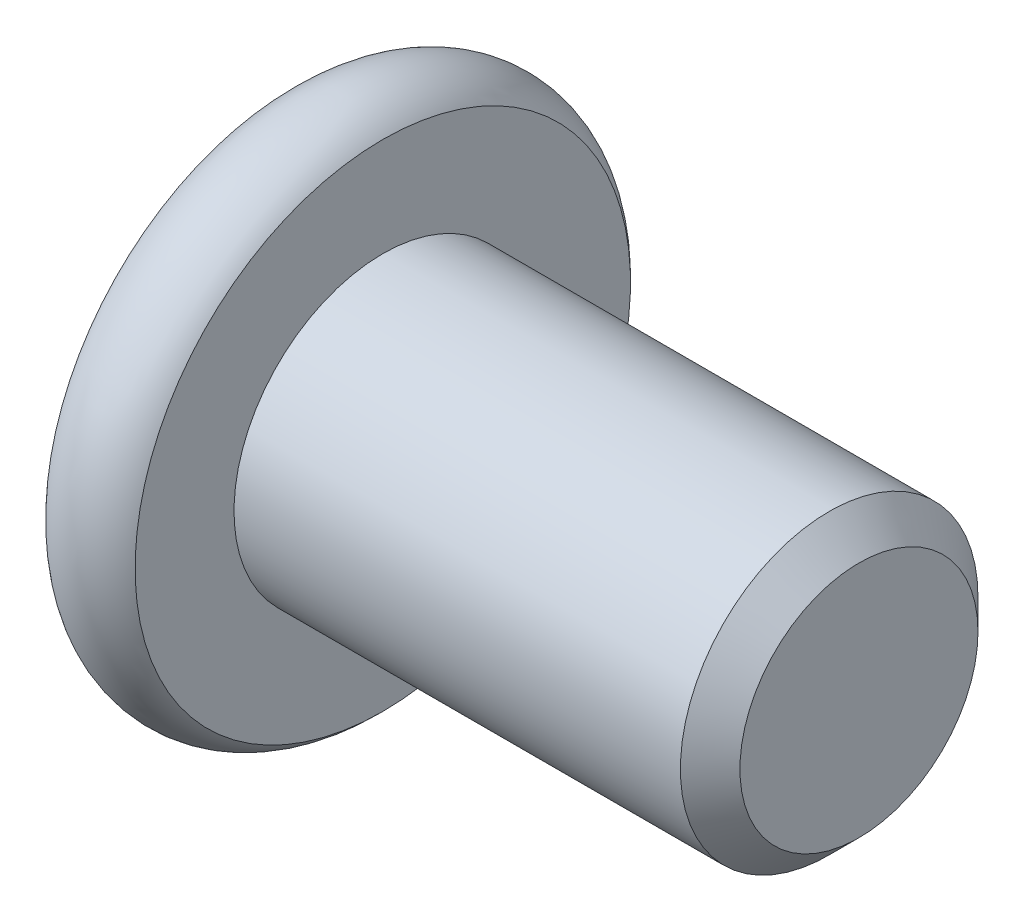
ISO-10303-21;
HEADER;
FILE_DESCRIPTION(('STEP AP214'),'2;1');
FILE_NAME('part.step','',(''),(''),'','','');
FILE_SCHEMA(('AUTOMOTIVE_DESIGN { 1 0 10303 214 1 1 1 1 }'));
ENDSEC;
DATA;
#1=APPLICATION_CONTEXT('core data for automotive mechanical design processes');
#2=APPLICATION_PROTOCOL_DEFINITION('international standard','automotive_design',2000,#1);
#3=PRODUCT_CONTEXT('',#1,'mechanical');
#4=PRODUCT('Part','Part','',(#3));
#5=PRODUCT_RELATED_PRODUCT_CATEGORY('part','',(#4));
#6=PRODUCT_DEFINITION_FORMATION('','',#4);
#7=PRODUCT_DEFINITION_CONTEXT('part definition',#1,'design');
#8=PRODUCT_DEFINITION('design','',#6,#7);
#9=PRODUCT_DEFINITION_SHAPE('','',#8);
#10=(LENGTH_UNIT() NAMED_UNIT(*) SI_UNIT(.MILLI.,.METRE.));
#11=(NAMED_UNIT(*) PLANE_ANGLE_UNIT() SI_UNIT($,.RADIAN.));
#12=(NAMED_UNIT(*) SI_UNIT($,.STERADIAN.) SOLID_ANGLE_UNIT());
#13=UNCERTAINTY_MEASURE_WITH_UNIT(LENGTH_MEASURE(1.E-05),#10,'distance_accuracy_value','');
#14=(GEOMETRIC_REPRESENTATION_CONTEXT(3) GLOBAL_UNCERTAINTY_ASSIGNED_CONTEXT((#13)) GLOBAL_UNIT_ASSIGNED_CONTEXT((#10,
#11,#12)) REPRESENTATION_CONTEXT('',''));
#15=CARTESIAN_POINT('',(0.,0.,0.));
#16=DIRECTION('',(0.,0.,1.));
#17=DIRECTION('',(1.,0.,0.));
#18=AXIS2_PLACEMENT_3D('',#15,#16,#17);
#19=CARTESIAN_POINT('',(-8.00000000000001,0.,0.));
#20=DIRECTION('',(1.,0.,0.));
#21=DIRECTION('',(0.,0.,-1.));
#22=AXIS2_PLACEMENT_3D('',#19,#20,#21);
#23=CYLINDRICAL_SURFACE('',#22,2.5);
#24=CARTESIAN_POINT('',(-0.499999999999945,0.,0.));
#25=DIRECTION('',(1.,0.,0.));
#26=DIRECTION('',(0.,0.,-1.));
#27=AXIS2_PLACEMENT_3D('',#24,#25,#26);
#28=CIRCLE('',#27,2.5);
#29=CARTESIAN_POINT('',(-0.499999999999946,0.,-2.5));
#30=VERTEX_POINT('',#29);
#31=EDGE_CURVE('E60',#30,#30,#28,.F.);
#32=ORIENTED_EDGE('',*,*,#31,.T.);
#33=EDGE_LOOP('',(#32));
#34=FACE_BOUND('',#33,.T.);
#35=CARTESIAN_POINT('',(-8.00000000000001,0.,0.));
#36=DIRECTION('',(1.,0.,0.));
#37=DIRECTION('',(0.,1.,0.));
#38=AXIS2_PLACEMENT_3D('',#35,#36,#37);
#39=CIRCLE('',#38,2.5);
#40=CARTESIAN_POINT('',(-8.00000000000001,2.5,0.));
#41=VERTEX_POINT('',#40);
#42=EDGE_CURVE('E136',#41,#41,#39,.F.);
#43=ORIENTED_EDGE('',*,*,#42,.F.);
#44=EDGE_LOOP('',(#43));
#45=FACE_BOUND('',#44,.T.);
#46=ADVANCED_FACE('F47',(#34,#45),#23,.T.);
#47=CARTESIAN_POINT('',(0.,0.,0.));
#48=DIRECTION('',(1.,0.,0.));
#49=DIRECTION('',(0.,0.,-1.));
#50=AXIS2_PLACEMENT_3D('',#47,#48,#49);
#51=PLANE('',#50);
#52=CARTESIAN_POINT('',(0.,0.,0.));
#53=DIRECTION('',(1.,0.,0.));
#54=DIRECTION('',(0.,0.,-1.));
#55=AXIS2_PLACEMENT_3D('',#52,#53,#54);
#56=CIRCLE('',#55,2.);
#57=CARTESIAN_POINT('',(0.,0.,-2.));
#58=VERTEX_POINT('',#57);
#59=EDGE_CURVE('E139',#58,#58,#56,.T.);
#60=ORIENTED_EDGE('',*,*,#59,.T.);
#61=EDGE_LOOP('',(#60));
#62=FACE_BOUND('',#61,.T.);
#63=ADVANCED_FACE('F149',(#62),#51,.T.);
#64=CARTESIAN_POINT('',(0.,0.,0.));
#65=DIRECTION('',(-1.,0.,0.));
#66=DIRECTION('',(0.,0.,1.));
#67=AXIS2_PLACEMENT_3D('',#64,#65,#66);
#68=CONICAL_SURFACE('',#67,2.,0.785398163397447);
#69=ORIENTED_EDGE('',*,*,#31,.F.);
#70=EDGE_LOOP('',(#69));
#71=FACE_BOUND('',#70,.T.);
#72=ORIENTED_EDGE('',*,*,#59,.F.);
#73=EDGE_LOOP('',(#72));
#74=FACE_BOUND('',#73,.T.);
#75=ADVANCED_FACE('F49',(#71,#74),#68,.T.);
#76=CARTESIAN_POINT('',(-9.50000000000006,0.,0.));
#77=DIRECTION('',(-1.,0.,0.));
#78=DIRECTION('',(0.,-1.,0.));
#79=AXIS2_PLACEMENT_3D('',#76,#77,#78);
#80=PLANE('',#79);
#81=CARTESIAN_POINT('',(-9.50000000000006,0.,0.));
#82=DIRECTION('',(-1.,0.,0.));
#83=DIRECTION('',(0.,-1.,0.));
#84=AXIS2_PLACEMENT_3D('',#81,#82,#83);
#85=CIRCLE('',#84,1.78205080756886);
#86=CARTESIAN_POINT('',(-9.50000000000007,-1.78205080756887,0.));
#87=VERTEX_POINT('',#86);
#88=EDGE_CURVE('E249',#87,#87,#85,.T.);
#89=ORIENTED_EDGE('',*,*,#88,.F.);
#90=EDGE_LOOP('',(#89));
#91=FACE_BOUND('',#90,.T.);
#92=CARTESIAN_POINT('',(-9.49999999999995,0.,0.));
#93=DIRECTION('',(1.,0.,0.));
#94=DIRECTION('',(0.,1.,0.));
#95=AXIS2_PLACEMENT_3D('',#92,#93,#94);
#96=CIRCLE('',#95,4.16143782776615);
#97=CARTESIAN_POINT('',(-9.49999999999995,4.16143782776616,0.));
#98=VERTEX_POINT('',#97);
#99=EDGE_CURVE('E133',#98,#98,#96,.T.);
#100=ORIENTED_EDGE('',*,*,#99,.F.);
#101=EDGE_LOOP('',(#100));
#102=FACE_BOUND('',#101,.T.);
#103=ADVANCED_FACE('F148',(#91,#102),#80,.T.);
#104=CARTESIAN_POINT('',(-8.75000000000004,0.,0.));
#105=DIRECTION('',(1.,0.,0.));
#106=DIRECTION('',(0.,1.,0.));
#107=AXIS2_PLACEMENT_3D('',#104,#105,#106);
#108=TOROIDAL_SURFACE('',#107,3.5,1.);
#109=ORIENTED_EDGE('',*,*,#99,.T.);
#110=EDGE_LOOP('',(#109));
#111=FACE_BOUND('',#110,.T.);
#112=CARTESIAN_POINT('',(-8.00000000000001,0.,0.));
#113=DIRECTION('',(1.,0.,0.));
#114=DIRECTION('',(0.,1.,0.));
#115=AXIS2_PLACEMENT_3D('',#112,#113,#114);
#116=CIRCLE('',#115,4.16143782776615);
#117=CARTESIAN_POINT('',(-8.00000000000001,4.16143782776616,0.));
#118=VERTEX_POINT('',#117);
#119=EDGE_CURVE('E130',#118,#118,#116,.T.);
#120=ORIENTED_EDGE('',*,*,#119,.F.);
#121=EDGE_LOOP('',(#120));
#122=FACE_BOUND('',#121,.T.);
#123=ADVANCED_FACE('F160',(#111,#122),#108,.T.);
#124=CARTESIAN_POINT('',(-8.00000000000001,4.1614378277661,2.4980018054066E-13));
#125=DIRECTION('',(1.,0.,0.));
#126=DIRECTION('',(0.,1.,0.));
#127=AXIS2_PLACEMENT_3D('',#124,#125,#126);
#128=PLANE('',#127);
#129=ORIENTED_EDGE('',*,*,#42,.T.);
#130=EDGE_LOOP('',(#129));
#131=FACE_BOUND('',#130,.T.);
#132=ORIENTED_EDGE('',*,*,#119,.T.);
#133=EDGE_LOOP('',(#132));
#134=FACE_BOUND('',#133,.T.);
#135=ADVANCED_FACE('F164',(#131,#134),#128,.T.);
#136=CARTESIAN_POINT('',(-9.50000000000006,0.,0.));
#137=DIRECTION('',(-1.,0.,0.));
#138=DIRECTION('',(0.,-1.,0.));
#139=AXIS2_PLACEMENT_3D('',#136,#137,#138);
#140=CONICAL_SURFACE('',#139,1.78205080756886,0.78539816339745);
#141=ORIENTED_EDGE('',*,*,#88,.T.);
#142=EDGE_LOOP('',(#141));
#143=FACE_BOUND('',#142,.T.);
#144=CARTESIAN_POINT('',(-10.015428085613,-1.74023253176586,1.50000000000006));
#145=CARTESIAN_POINT('',(-9.98338110734456,-1.69791724929735,1.50000000000006));
#146=CARTESIAN_POINT('',(-9.95164446728414,-1.65536760966794,1.50000000000006));
#147=CARTESIAN_POINT('',(-9.8889203936154,-1.56970398156686,1.50000000000006));
#148=CARTESIAN_POINT('',(-9.85793314822007,-1.5265898554285,1.50000000000006));
#149=CARTESIAN_POINT('',(-9.76584616434506,-1.39562626326564,1.50000000000006));
#150=CARTESIAN_POINT('',(-9.70611451230219,-1.30679868010575,1.50000000000005));
#151=CARTESIAN_POINT('',(-9.58873428910132,-1.12044622640211,1.50000000000007));
#152=CARTESIAN_POINT('',(-9.53140827748237,-1.02271587306666,1.50000000000009));
#153=CARTESIAN_POINT('',(-9.42646321497598,-0.822357214965237,1.50000000000002));
#154=CARTESIAN_POINT('',(-9.37881142368949,-0.719746931701968,1.49999999999993));
#155=CARTESIAN_POINT('',(-9.32050998831503,-0.565852387095121,1.49999999999999));
#156=CARTESIAN_POINT('',(-9.30379905354099,-0.516874191424687,1.50000000000004));
#157=CARTESIAN_POINT('',(-9.27430775150904,-0.417723988457511,1.50000000000008));
#158=CARTESIAN_POINT('',(-9.26152765142203,-0.367551900263886,1.50000000000006));
#159=CARTESIAN_POINT('',(-9.24077842024589,-0.267158299056141,1.50000000000005));
#160=CARTESIAN_POINT('',(-9.23272606182609,-0.216954261864873,1.50000000000005));
#161=CARTESIAN_POINT('',(-9.22159163683411,-0.115994915871346,1.50000000000007));
#162=CARTESIAN_POINT('',(-9.21850868863767,-0.0652397064615748,1.50000000000008));
#163=CARTESIAN_POINT('',(-9.21754738974036,0.0344222234875093,1.50000000000008));
#164=CARTESIAN_POINT('',(-9.21947892169524,0.0833271701100424,1.50000000000007));
#165=CARTESIAN_POINT('',(-9.22801757296782,0.180724293127185,1.50000000000005));
#166=CARTESIAN_POINT('',(-9.23462514204816,0.229216429361703,1.50000000000005));
#167=CARTESIAN_POINT('',(-9.25226506264482,0.326258027696993,1.50000000000007));
#168=CARTESIAN_POINT('',(-9.26337316820113,0.374793507450013,1.50000000000009));
#169=CARTESIAN_POINT('',(-9.28941986695963,0.470802295834196,1.50000000000003));
#170=CARTESIAN_POINT('',(-9.30435815600352,0.518275688481328,1.49999999999995));
#171=CARTESIAN_POINT('',(-9.35683954571587,0.667150562065192,1.49999999999985));
#172=CARTESIAN_POINT('',(-9.40033511654423,0.766448362426831,1.5));
#173=CARTESIAN_POINT('',(-9.49705878148379,0.960384405673752,1.50000000000011));
#174=CARTESIAN_POINT('',(-9.55032172266759,1.05500437383614,1.50000000000007));
#175=CARTESIAN_POINT('',(-9.66022580104543,1.23584520321527,1.50000000000004));
#176=CARTESIAN_POINT('',(-9.7165682531047,1.32224986946546,1.50000000000005));
#177=CARTESIAN_POINT('',(-9.80367557259713,1.44954953726468,1.50000000000006));
#178=CARTESIAN_POINT('',(-9.83301999068399,1.49143368482417,1.50000000000006));
#179=CARTESIAN_POINT('',(-9.89248691829314,1.57462914783239,1.50000000000005));
#180=CARTESIAN_POINT('',(-9.92260921150077,1.61594061772576,1.50000000000005));
#181=CARTESIAN_POINT('',(-9.95305411813652,1.65701358742554,1.50000000000003));
#182=B_SPLINE_CURVE_WITH_KNOTS('',3,(#144,#145,#146,#147,#148,#149,#150,#151,#152,#153,#154,
#155,#156,#157,#158,#159,#160,#161,#162,#163,#164,#165,#166,#167,#168,#169,#170,#171,#172,#173,
#174,#175,#176,#177,#178,#179,#180,#181),.UNSPECIFIED.,.F.,.F.,(4,2,2,2,2,2,2,2,2,2,2,2,2,2,2,2,
2,2,4),(0.,0.159238974218343,0.318517535014526,0.639504781932422,0.97913789379925,
1.31760168934359,1.47272233841624,1.62785352839776,1.78016486537347,1.93244917778277,
2.07904486260296,2.22565464958334,2.37484213303403,2.52401777304044,2.84828365283773,
3.17372975666747,3.48303030530537,3.63644667013906,3.78982082222908),.UNSPECIFIED.);
#183=CARTESIAN_POINT('',(-9.44999999999996,-0.866025403784498,1.50000000000006));
#184=VERTEX_POINT('',#183);
#185=CARTESIAN_POINT('',(-9.44999999999996,0.866025403784415,1.50000000000014));
#186=VERTEX_POINT('',#185);
#187=EDGE_CURVE('E114',#184,#186,#182,.T.);
#188=ORIENTED_EDGE('',*,*,#187,.F.);
#189=CARTESIAN_POINT('',(-9.45011548160013,-1.73216627762257,-0.000200000000089018));
#190=CARTESIAN_POINT('',(-9.4203654760674,-1.70239359975909,0.0513677907370307));
#191=CARTESIAN_POINT('',(-9.39236248391039,-1.67212305186353,0.10379791766517));
#192=CARTESIAN_POINT('',(-9.34108923044022,-1.6103978900362,0.210709034055569));
#193=CARTESIAN_POINT('',(-9.31784750504445,-1.57893740312614,0.265200195814623));
#194=CARTESIAN_POINT('',(-9.2780337289923,-1.51549879897988,0.375079081357194));
#195=CARTESIAN_POINT('',(-9.26136158567098,-1.48353684526811,0.43043880909514));
#196=CARTESIAN_POINT('',(-9.23567445681818,-1.41890915196214,0.542377257477076));
#197=CARTESIAN_POINT('',(-9.22664029047893,-1.38624538781121,0.598952556552924));
#198=CARTESIAN_POINT('',(-9.21848908122691,-1.32995210095303,0.696455389516345));
#199=CARTESIAN_POINT('',(-9.21728225298928,-1.30639533311128,0.737256908280368));
#200=CARTESIAN_POINT('',(-9.21931405716233,-1.25932335290197,0.818787969615751));
#201=CARTESIAN_POINT('',(-9.22255367074836,-1.23580815085316,0.859517494314516));
#202=CARTESIAN_POINT('',(-9.23329198598201,-1.18900414978432,0.940584402163308));
#203=CARTESIAN_POINT('',(-9.24079465301878,-1.16571558211728,0.980921384598193));
#204=CARTESIAN_POINT('',(-9.25965161192832,-1.11952932016336,1.06091833691389));
#205=CARTESIAN_POINT('',(-9.2710075570186,-1.09663179808777,1.10057800851601));
#206=CARTESIAN_POINT('',(-9.30472164759268,-1.03798159809681,1.20216313477429));
#207=CARTESIAN_POINT('',(-9.3296218490934,-1.00259267147463,1.26345855370963));
#208=CARTESIAN_POINT('',(-9.37165665327165,-0.950557780604364,1.35358562846333));
#209=CARTESIAN_POINT('',(-9.38642515355919,-0.933410759677108,1.38328513990774));
#210=CARTESIAN_POINT('',(-9.41731056594026,-0.899432101996352,1.44213790138382));
#211=CARTESIAN_POINT('',(-9.4334268341218,-0.882600319285669,1.47129140422074));
#212=CARTESIAN_POINT('',(-9.45011548160013,-0.865909933730646,1.5002000000002));
#213=B_SPLINE_CURVE_WITH_KNOTS('',3,(#189,#190,#191,#192,#193,#194,#195,#196,#197,#198,#199,
#200,#201,#202,#203,#204,#205,#206,#207,#208,#209,#210,#211,#212),.UNSPECIFIED.,.F.,.F.,(4,2,2,
2,2,2,2,2,2,2,2,4),(0.,0.19982914369328,0.400822987382347,0.598623720538115,0.795926240188796,
0.937113067959776,1.07833105577181,1.21968061668209,1.36109089931041,1.58570969637566,
1.69770705470971,1.80965120737207),.UNSPECIFIED.);
#214=CARTESIAN_POINT('',(-9.45000000000007,-1.73205080756894,-1.38777878078145E-13));
#215=VERTEX_POINT('',#214);
#216=EDGE_CURVE('E206',#215,#184,#213,.T.);
#217=ORIENTED_EDGE('',*,*,#216,.F.);
#218=CARTESIAN_POINT('',(-9.45011548160013,-0.86590993373073,-1.50020000000006));
#219=CARTESIAN_POINT('',(-9.42036547606748,-0.895682611594317,-1.44863220926297));
#220=CARTESIAN_POINT('',(-9.3923624839105,-0.925953159489912,-1.39620208233484));
#221=CARTESIAN_POINT('',(-9.34108923044035,-0.987678321317263,-1.28929096594444));
#222=CARTESIAN_POINT('',(-9.31784750504456,-1.01913880822731,-1.23479980418537));
#223=CARTESIAN_POINT('',(-9.27803372899244,-1.08257741237361,-1.12492091864278));
#224=CARTESIAN_POINT('',(-9.26136158567115,-1.11453936608541,-1.06956119090483));
#225=CARTESIAN_POINT('',(-9.23567445681827,-1.17916705939133,-0.957622742522848));
#226=CARTESIAN_POINT('',(-9.22664029047889,-1.21183082354215,-0.901047443446955));
#227=CARTESIAN_POINT('',(-9.21848908122693,-1.26812411040036,-0.803544610483565));
#228=CARTESIAN_POINT('',(-9.21728225298941,-1.29168087824218,-0.762743091719589));
#229=CARTESIAN_POINT('',(-9.21931405716253,-1.33875285845152,-0.681212030384239));
#230=CARTESIAN_POINT('',(-9.22255367074853,-1.3622680605003,-0.640482505685458));
#231=CARTESIAN_POINT('',(-9.23329198598218,-1.40907206156916,-0.559415597836692));
#232=CARTESIAN_POINT('',(-9.24079465301899,-1.43236062923624,-0.519078615401849));
#233=CARTESIAN_POINT('',(-9.25965161192846,-1.47854689119004,-0.439081663086079));
#234=CARTESIAN_POINT('',(-9.27100755701863,-1.50144441326546,-0.399421991483845));
#235=CARTESIAN_POINT('',(-9.30472164759263,-1.56009461325629,-0.297836865225539));
#236=CARTESIAN_POINT('',(-9.32962184909349,-1.5954835398787,-0.236541446290442));
#237=CARTESIAN_POINT('',(-9.37165665327177,-1.64751843074903,-0.146414371536874));
#238=CARTESIAN_POINT('',(-9.38642515355928,-1.66466545167626,-0.116714860092469));
#239=CARTESIAN_POINT('',(-9.41731056594031,-1.69864410935696,-0.0578620986163914));
#240=CARTESIAN_POINT('',(-9.43342683412181,-1.71547589206761,-0.0287085957794609));
#241=CARTESIAN_POINT('',(-9.45011548160013,-1.73216627762263,0.000199999999977996));
#242=B_SPLINE_CURVE_WITH_KNOTS('',3,(#218,#219,#220,#221,#222,#223,#224,#225,#226,#227,#228,
#229,#230,#231,#232,#233,#234,#235,#236,#237,#238,#239,#240,#241),.UNSPECIFIED.,.F.,.F.,(4,2,2,
2,2,2,2,2,2,2,2,4),(0.,0.199829143693258,0.400822987382367,0.598623720538178,0.795926240188866,
0.937113067959812,1.07833105577184,1.2196806166821,1.36109089931038,1.58570969637549,
1.69770705470948,1.80965120737177),.UNSPECIFIED.);
#243=CARTESIAN_POINT('',(-9.44999999999996,-0.866025403784582,-1.50000000000006));
#244=VERTEX_POINT('',#243);
#245=EDGE_CURVE('E201',#244,#215,#242,.T.);
#246=ORIENTED_EDGE('',*,*,#245,.F.);
#247=CARTESIAN_POINT('',(-10.015428085613,-1.74023253176597,-1.49999999999997));
#248=CARTESIAN_POINT('',(-9.9833811073446,-1.69791724929743,-1.50000000000004));
#249=CARTESIAN_POINT('',(-9.95164446728419,-1.65536760966801,-1.50000000000007));
#250=CARTESIAN_POINT('',(-9.88892039361546,-1.56970398156691,-1.50000000000009));
#251=CARTESIAN_POINT('',(-9.85793314822013,-1.52658985542856,-1.50000000000009));
#252=CARTESIAN_POINT('',(-9.7658461643451,-1.3956262632657,-1.50000000000007));
#253=CARTESIAN_POINT('',(-9.70611451230223,-1.3067986801058,-1.50000000000008));
#254=CARTESIAN_POINT('',(-9.58873428910136,-1.12044622640214,-1.50000000000008));
#255=CARTESIAN_POINT('',(-9.53140827748241,-1.02271587306668,-1.50000000000008));
#256=CARTESIAN_POINT('',(-9.42646321497599,-0.822357214965246,-1.50000000000008));
#257=CARTESIAN_POINT('',(-9.37881142368948,-0.719746931701978,-1.50000000000008));
#258=CARTESIAN_POINT('',(-9.32050998831503,-0.56585238709512,-1.50000000000009));
#259=CARTESIAN_POINT('',(-9.30379905354101,-0.516874191424683,-1.50000000000009));
#260=CARTESIAN_POINT('',(-9.27430775150906,-0.417723988457505,-1.50000000000008));
#261=CARTESIAN_POINT('',(-9.26152765142205,-0.36755190026388,-1.50000000000007));
#262=CARTESIAN_POINT('',(-9.24077842024592,-0.267158299056135,-1.50000000000009));
#263=CARTESIAN_POINT('',(-9.23272606182612,-0.216954261864868,-1.50000000000012));
#264=CARTESIAN_POINT('',(-9.22159163683413,-0.115994915871342,-1.50000000000005));
#265=CARTESIAN_POINT('',(-9.21850868863767,-0.0652397064615729,-1.49999999999994));
#266=CARTESIAN_POINT('',(-9.21754738974036,0.0344222234875054,-1.49999999999995));
#267=CARTESIAN_POINT('',(-9.21947892169526,0.0833271701100348,-1.50000000000005));
#268=CARTESIAN_POINT('',(-9.22801757296785,0.180724293127172,-1.50000000000012));
#269=CARTESIAN_POINT('',(-9.23462514204818,0.229216429361688,-1.50000000000009));
#270=CARTESIAN_POINT('',(-9.25226506264483,0.326258027696973,-1.50000000000007));
#271=CARTESIAN_POINT('',(-9.26337316820115,0.37479350744999,-1.50000000000009));
#272=CARTESIAN_POINT('',(-9.28941986695964,0.47080229583417,-1.50000000000008));
#273=CARTESIAN_POINT('',(-9.30435815600353,0.518275688481302,-1.50000000000006));
#274=CARTESIAN_POINT('',(-9.35683954571586,0.667150562065168,-1.50000000000004));
#275=CARTESIAN_POINT('',(-9.40033511654423,0.766448362426804,-1.50000000000007));
#276=CARTESIAN_POINT('',(-9.4970587814838,0.960384405673727,-1.5000000000001));
#277=CARTESIAN_POINT('',(-9.5503217226676,1.05500437383612,-1.50000000000009));
#278=CARTESIAN_POINT('',(-9.66022580104544,1.23584520321526,-1.50000000000008));
#279=CARTESIAN_POINT('',(-9.71656825310471,1.32224986946545,-1.50000000000007));
#280=CARTESIAN_POINT('',(-9.80367557259714,1.44954953726468,-1.50000000000009));
#281=CARTESIAN_POINT('',(-9.83301999068401,1.49143368482416,-1.50000000000011));
#282=CARTESIAN_POINT('',(-9.89248691829315,1.57462914783238,-1.50000000000006));
#283=CARTESIAN_POINT('',(-9.92260921150078,1.61594061772575,-1.49999999999999));
#284=CARTESIAN_POINT('',(-9.95305411813652,1.65701358742554,-1.49999999999983));
#285=B_SPLINE_CURVE_WITH_KNOTS('',3,(#247,#248,#249,#250,#251,#252,#253,#254,#255,#256,#257,
#258,#259,#260,#261,#262,#263,#264,#265,#266,#267,#268,#269,#270,#271,#272,#273,#274,#275,#276,
#277,#278,#279,#280,#281,#282,#283,#284),.UNSPECIFIED.,.F.,.F.,(4,2,2,2,2,2,2,2,2,2,2,2,2,2,2,2,
2,2,4),(0.,0.159238974218347,0.318517535014536,0.639504781932454,0.979137893799315,
1.31760168934368,1.47272233841633,1.62785352839784,1.78016486537355,1.93244917778285,
2.07904486260303,2.2256546495834,2.37484213303408,2.52401777304048,2.84828365283779,
3.17372975666754,3.48303030530544,3.63644667013913,3.78982082222915),.UNSPECIFIED.);
#286=CARTESIAN_POINT('',(-9.44999999999996,0.86602540378436,-1.4999999999997));
#287=VERTEX_POINT('',#286);
#288=EDGE_CURVE('E67',#287,#244,#285,.F.);
#289=ORIENTED_EDGE('',*,*,#288,.F.);
#290=CARTESIAN_POINT('',(-9.45011548160013,1.73216627762285,0.000199999999894729));
#291=CARTESIAN_POINT('',(-9.4203654760674,1.70239359975919,-0.0513677907371296));
#292=CARTESIAN_POINT('',(-9.39236248391038,1.67212305186356,-0.103797917665231));
#293=CARTESIAN_POINT('',(-9.3410892304402,1.61039789003617,-0.210709034055617));
#294=CARTESIAN_POINT('',(-9.31784750504442,1.57893740312612,-0.265200195814697));
#295=CARTESIAN_POINT('',(-9.27803372899229,1.51549879897985,-0.375079081357311));
#296=CARTESIAN_POINT('',(-9.26136158567099,1.48353684526807,-0.430438809095273));
#297=CARTESIAN_POINT('',(-9.23567445681813,1.41890915196207,-0.542377257477216));
#298=CARTESIAN_POINT('',(-9.22664029047879,1.38624538781113,-0.598952556553054));
#299=CARTESIAN_POINT('',(-9.21848908122682,1.32995210095295,-0.696455389516486));
#300=CARTESIAN_POINT('',(-9.21728225298927,1.30639533311121,-0.73725690828052));
#301=CARTESIAN_POINT('',(-9.21931405716238,1.25932335290191,-0.818787969615921));
#302=CARTESIAN_POINT('',(-9.22255367074839,1.2358081508531,-0.859517494314693));
#303=CARTESIAN_POINT('',(-9.23329198598205,1.18900414978423,-0.940584402163481));
#304=CARTESIAN_POINT('',(-9.24079465301884,1.16571558211717,-0.980921384598355));
#305=CARTESIAN_POINT('',(-9.25965161192837,1.11952932016331,-1.0609183369141));
#306=CARTESIAN_POINT('',(-9.27100755701861,1.09663179808778,-1.10057800851627));
#307=CARTESIAN_POINT('',(-9.30472164759265,1.0379815980969,-1.20216313477452));
#308=CARTESIAN_POINT('',(-9.32962184909343,1.00259267147464,-1.26345855370971));
#309=CARTESIAN_POINT('',(-9.37165665327166,0.950557780604394,-1.3535856284633));
#310=CARTESIAN_POINT('',(-9.38642515355916,0.933410759677166,-1.38328513990769));
#311=CARTESIAN_POINT('',(-9.41731056594022,0.899432101996442,-1.44213790138371));
#312=CARTESIAN_POINT('',(-9.43342683412175,0.882600319285764,-1.47129140422059));
#313=CARTESIAN_POINT('',(-9.45011548160013,0.865909933730702,-1.50019999999995));
#314=B_SPLINE_CURVE_WITH_KNOTS('',3,(#290,#291,#292,#293,#294,#295,#296,#297,#298,#299,#300,
#301,#302,#303,#304,#305,#306,#307,#308,#309,#310,#311,#312,#313),.UNSPECIFIED.,.F.,.F.,(4,2,2,
2,2,2,2,2,2,2,2,4),(0.,0.199829143693296,0.400822987382418,0.598623720538234,0.795926240188941,
0.937113067959926,1.07833105577198,1.21968061668228,1.36109089931061,1.58570969637564,
1.69770705470958,1.80965120737184),.UNSPECIFIED.);
#315=CARTESIAN_POINT('',(-9.44999999999996,1.73205080756886,0.));
#316=VERTEX_POINT('',#315);
#317=EDGE_CURVE('E13',#316,#287,#314,.T.);
#318=ORIENTED_EDGE('',*,*,#317,.F.);
#319=CARTESIAN_POINT('',(-9.45011548160013,0.865909933730452,1.50020000000003));
#320=CARTESIAN_POINT('',(-9.42036547606746,0.895682611594133,1.44863220926299));
#321=CARTESIAN_POINT('',(-9.39236248391046,0.925953159489776,1.39620208233487));
#322=CARTESIAN_POINT('',(-9.34108923044028,0.987678321317176,1.28929096594445));
#323=CARTESIAN_POINT('',(-9.31784750504449,1.01913880822722,1.23479980418536));
#324=CARTESIAN_POINT('',(-9.27803372899235,1.08257741237352,1.12492091864274));
#325=CARTESIAN_POINT('',(-9.26136158567106,1.11453936608532,1.06956119090478));
#326=CARTESIAN_POINT('',(-9.23567445681817,1.17916705939128,0.957622742522794));
#327=CARTESIAN_POINT('',(-9.22664029047878,1.21183082354216,0.901047443446916));
#328=CARTESIAN_POINT('',(-9.21848908122683,1.26812411040036,0.803544610483502));
#329=CARTESIAN_POINT('',(-9.21728225298931,1.29168087824214,0.762743091719503));
#330=CARTESIAN_POINT('',(-9.21931405716244,1.33875285845147,0.681212030384135));
#331=CARTESIAN_POINT('',(-9.22255367074845,1.36226806050026,0.640482505685361));
#332=CARTESIAN_POINT('',(-9.23329198598209,1.40907206156911,0.559415597836586));
#333=CARTESIAN_POINT('',(-9.24079465301889,1.43236062923618,0.519078615401727));
#334=CARTESIAN_POINT('',(-9.2596516119284,1.47854689119002,0.439081663085979));
#335=CARTESIAN_POINT('',(-9.27100755701862,1.5014444132655,0.399421991483783));
#336=CARTESIAN_POINT('',(-9.30472164759265,1.56009461325637,0.297836865225505));
#337=CARTESIAN_POINT('',(-9.32962184909345,1.5954835398787,0.23654144629035));
#338=CARTESIAN_POINT('',(-9.3716566532717,1.64751843074897,0.146414371536748));
#339=CARTESIAN_POINT('',(-9.38642515355922,1.6646654516762,0.116714860092342));
#340=CARTESIAN_POINT('',(-9.41731056594026,1.69864410935694,0.0578620986163103));
#341=CARTESIAN_POINT('',(-9.43342683412178,1.71547589206765,0.0287085957794268));
#342=CARTESIAN_POINT('',(-9.45011548160013,1.73216627762279,-0.000199999999922484));
#343=B_SPLINE_CURVE_WITH_KNOTS('',3,(#319,#320,#321,#322,#323,#324,#325,#326,#327,#328,#329,
#330,#331,#332,#333,#334,#335,#336,#337,#338,#339,#340,#341,#342),.UNSPECIFIED.,.F.,.F.,(4,2,2,
2,2,2,2,2,2,2,2,4),(0.,0.199829143693319,0.400822987382486,0.598623720538332,0.795926240189059,
0.937113067960015,1.07833105577205,1.21968061668232,1.36109089931063,1.58570969637572,
1.69770705470969,1.80965120737198),.UNSPECIFIED.);
#344=EDGE_CURVE('E105',#186,#316,#343,.T.);
#345=ORIENTED_EDGE('',*,*,#344,.F.);
#346=EDGE_LOOP('',(#188,#217,#246,#289,#318,#345));
#347=FACE_BOUND('',#346,.T.);
#348=ADVANCED_FACE('F104',(#143,#347),#140,.F.);
#349=CARTESIAN_POINT('',(-7.19999999999998,0.,0.));
#350=DIRECTION('',(-1.,0.,0.));
#351=DIRECTION('',(0.,-1.,0.));
#352=AXIS2_PLACEMENT_3D('',#349,#350,#351);
#353=PLANE('',#352);
#354=DIRECTION('',(0.,0.5,-0.866025403784439));
#355=VECTOR('',#354,1.);
#356=CARTESIAN_POINT('',(-7.19999999999998,0.866025403784415,1.50000000000014));
#357=LINE('',#356,#355);
#358=CARTESIAN_POINT('',(-7.19999999999998,0.866025403784415,1.50000000000014));
#359=VERTEX_POINT('',#358);
#360=CARTESIAN_POINT('',(-7.19999999999998,1.73205080756886,0.));
#361=VERTEX_POINT('',#360);
#362=EDGE_CURVE('E113',#359,#361,#357,.T.);
#363=ORIENTED_EDGE('',*,*,#362,.T.);
#364=DIRECTION('',(0.,-0.500000000000001,-0.86602540378444));
#365=VECTOR('',#364,1.);
#366=CARTESIAN_POINT('',(-7.19999999999998,1.73205080756886,0.));
#367=LINE('',#366,#365);
#368=CARTESIAN_POINT('',(-7.19999999999998,0.866025403784387,-1.50000000000008));
#369=VERTEX_POINT('',#368);
#370=EDGE_CURVE('E118',#361,#369,#367,.T.);
#371=ORIENTED_EDGE('',*,*,#370,.T.);
#372=DIRECTION('',(0.,-1.,0.));
#373=VECTOR('',#372,1.);
#374=CARTESIAN_POINT('',(-7.19999999999998,0.866025403784387,-1.50000000000008));
#375=LINE('',#374,#373);
#376=CARTESIAN_POINT('',(-7.19999999999998,-0.866025403784582,-1.50000000000006));
#377=VERTEX_POINT('',#376);
#378=EDGE_CURVE('E231',#369,#377,#375,.T.);
#379=ORIENTED_EDGE('',*,*,#378,.T.);
#380=DIRECTION('',(0.,-0.5,0.866025403784439));
#381=VECTOR('',#380,1.);
#382=CARTESIAN_POINT('',(-7.19999999999998,-0.866025403784582,-1.50000000000006));
#383=LINE('',#382,#381);
#384=CARTESIAN_POINT('',(-7.19999999999998,-1.73205080756894,-1.38777878078145E-13));
#385=VERTEX_POINT('',#384);
#386=EDGE_CURVE('E235',#377,#385,#383,.T.);
#387=ORIENTED_EDGE('',*,*,#386,.T.);
#388=DIRECTION('',(0.,0.500000000000001,0.86602540378444));
#389=VECTOR('',#388,1.);
#390=CARTESIAN_POINT('',(-7.19999999999998,-1.73205080756894,-1.38777878078145E-13));
#391=LINE('',#390,#389);
#392=CARTESIAN_POINT('',(-7.19999999999998,-0.866025403784498,1.50000000000006));
#393=VERTEX_POINT('',#392);
#394=EDGE_CURVE('E126',#385,#393,#391,.T.);
#395=ORIENTED_EDGE('',*,*,#394,.T.);
#396=DIRECTION('',(0.,1.,0.));
#397=VECTOR('',#396,1.);
#398=CARTESIAN_POINT('',(-7.19999999999998,-0.866025403784498,1.50000000000006));
#399=LINE('',#398,#397);
#400=EDGE_CURVE('E121',#393,#359,#399,.T.);
#401=ORIENTED_EDGE('',*,*,#400,.T.);
#402=EDGE_LOOP('',(#363,#371,#379,#387,#395,#401));
#403=FACE_BOUND('',#402,.T.);
#404=ADVANCED_FACE('F188',(#403),#353,.T.);
#405=CARTESIAN_POINT('',(-7.19999999999998,1.73205080756886,0.));
#406=DIRECTION('',(0.,0.86602540378444,-0.5));
#407=DIRECTION('',(0.,0.500000000000001,0.86602540378444));
#408=AXIS2_PLACEMENT_3D('',#405,#406,#407);
#409=PLANE('',#408);
#410=DIRECTION('',(-1.,0.,0.));
#411=VECTOR('',#410,1.);
#412=CARTESIAN_POINT('',(-7.19999999999998,1.73205080756886,0.));
#413=LINE('',#412,#411);
#414=EDGE_CURVE('E111',#361,#316,#413,.T.);
#415=ORIENTED_EDGE('',*,*,#414,.T.);
#416=ORIENTED_EDGE('',*,*,#317,.T.);
#417=DIRECTION('',(-1.,0.,0.));
#418=VECTOR('',#417,1.);
#419=CARTESIAN_POINT('',(-7.19999999999998,0.866025403784387,-1.50000000000008));
#420=LINE('',#419,#418);
#421=EDGE_CURVE('E120',#369,#287,#420,.T.);
#422=ORIENTED_EDGE('',*,*,#421,.F.);
#423=ORIENTED_EDGE('',*,*,#370,.F.);
#424=EDGE_LOOP('',(#415,#416,#422,#423));
#425=FACE_BOUND('',#424,.T.);
#426=ADVANCED_FACE('F116',(#425),#409,.F.);
#427=CARTESIAN_POINT('',(-7.19999999999998,0.866025403784387,-1.50000000000008));
#428=DIRECTION('',(0.,0.,-1.));
#429=DIRECTION('',(-1.,0.,0.));
#430=AXIS2_PLACEMENT_3D('',#427,#428,#429);
#431=PLANE('',#430);
#432=ORIENTED_EDGE('',*,*,#421,.T.);
#433=ORIENTED_EDGE('',*,*,#288,.T.);
#434=DIRECTION('',(-1.,0.,0.));
#435=VECTOR('',#434,1.);
#436=CARTESIAN_POINT('',(-7.19999999999998,-0.866025403784582,-1.50000000000006));
#437=LINE('',#436,#435);
#438=EDGE_CURVE('E123',#377,#244,#437,.T.);
#439=ORIENTED_EDGE('',*,*,#438,.F.);
#440=ORIENTED_EDGE('',*,*,#378,.F.);
#441=EDGE_LOOP('',(#432,#433,#439,#440));
#442=FACE_BOUND('',#441,.T.);
#443=ADVANCED_FACE('F220',(#442),#431,.F.);
#444=CARTESIAN_POINT('',(-7.19999999999998,-0.866025403784582,-1.50000000000006));
#445=DIRECTION('',(0.,-0.866025403784441,-0.500000000000001));
#446=DIRECTION('',(0.,0.500000000000001,-0.866025403784439));
#447=AXIS2_PLACEMENT_3D('',#444,#445,#446);
#448=PLANE('',#447);
#449=ORIENTED_EDGE('',*,*,#438,.T.);
#450=ORIENTED_EDGE('',*,*,#245,.T.);
#451=DIRECTION('',(-1.,0.,0.));
#452=VECTOR('',#451,1.);
#453=CARTESIAN_POINT('',(-7.19999999999998,-1.73205080756894,-1.38777878078145E-13));
#454=LINE('',#453,#452);
#455=EDGE_CURVE('E245',#385,#215,#454,.T.);
#456=ORIENTED_EDGE('',*,*,#455,.F.);
#457=ORIENTED_EDGE('',*,*,#386,.F.);
#458=EDGE_LOOP('',(#449,#450,#456,#457));
#459=FACE_BOUND('',#458,.T.);
#460=ADVANCED_FACE('F215',(#459),#448,.F.);
#461=CARTESIAN_POINT('',(-7.19999999999998,-1.73205080756894,-1.38777878078145E-13));
#462=DIRECTION('',(0.,-0.86602540378444,0.5));
#463=DIRECTION('',(0.,-0.500000000000001,-0.86602540378444));
#464=AXIS2_PLACEMENT_3D('',#461,#462,#463);
#465=PLANE('',#464);
#466=ORIENTED_EDGE('',*,*,#455,.T.);
#467=ORIENTED_EDGE('',*,*,#216,.T.);
#468=DIRECTION('',(-1.,0.,0.));
#469=VECTOR('',#468,1.);
#470=CARTESIAN_POINT('',(-7.19999999999998,-0.866025403784498,1.50000000000006));
#471=LINE('',#470,#469);
#472=EDGE_CURVE('E242',#393,#184,#471,.T.);
#473=ORIENTED_EDGE('',*,*,#472,.F.);
#474=ORIENTED_EDGE('',*,*,#394,.F.);
#475=EDGE_LOOP('',(#466,#467,#473,#474));
#476=FACE_BOUND('',#475,.T.);
#477=ADVANCED_FACE('F212',(#476),#465,.F.);
#478=CARTESIAN_POINT('',(-7.19999999999998,-0.866025403784498,1.50000000000006));
#479=DIRECTION('',(0.,0.,1.));
#480=DIRECTION('',(1.,0.,0.));
#481=AXIS2_PLACEMENT_3D('',#478,#479,#480);
#482=PLANE('',#481);
#483=ORIENTED_EDGE('',*,*,#472,.T.);
#484=ORIENTED_EDGE('',*,*,#187,.T.);
#485=DIRECTION('',(-1.,0.,0.));
#486=VECTOR('',#485,1.);
#487=CARTESIAN_POINT('',(-7.19999999999998,0.866025403784415,1.50000000000014));
#488=LINE('',#487,#486);
#489=EDGE_CURVE('E74',#359,#186,#488,.T.);
#490=ORIENTED_EDGE('',*,*,#489,.F.);
#491=ORIENTED_EDGE('',*,*,#400,.F.);
#492=EDGE_LOOP('',(#483,#484,#490,#491));
#493=FACE_BOUND('',#492,.T.);
#494=ADVANCED_FACE('F171',(#493),#482,.F.);
#495=CARTESIAN_POINT('',(-7.19999999999998,0.866025403784415,1.50000000000014));
#496=DIRECTION('',(0.,0.866025403784441,0.500000000000001));
#497=DIRECTION('',(0.,-0.500000000000001,0.866025403784439));
#498=AXIS2_PLACEMENT_3D('',#495,#496,#497);
#499=PLANE('',#498);
#500=ORIENTED_EDGE('',*,*,#489,.T.);
#501=ORIENTED_EDGE('',*,*,#344,.T.);
#502=ORIENTED_EDGE('',*,*,#414,.F.);
#503=ORIENTED_EDGE('',*,*,#362,.F.);
#504=EDGE_LOOP('',(#500,#501,#502,#503));
#505=FACE_BOUND('',#504,.T.);
#506=ADVANCED_FACE('F110',(#505),#499,.F.);
#507=CLOSED_SHELL('',(#46,#63,#75,#103,#123,#135,#348,#404,#426,#443,#460,#477,#494,#506));
#508=MANIFOLD_SOLID_BREP('B2',#507);
#509=ADVANCED_BREP_SHAPE_REPRESENTATION('',(#18,#508),#14);
#510=SHAPE_DEFINITION_REPRESENTATION(#9,#509);
ENDSEC;
END-ISO-10303-21;
